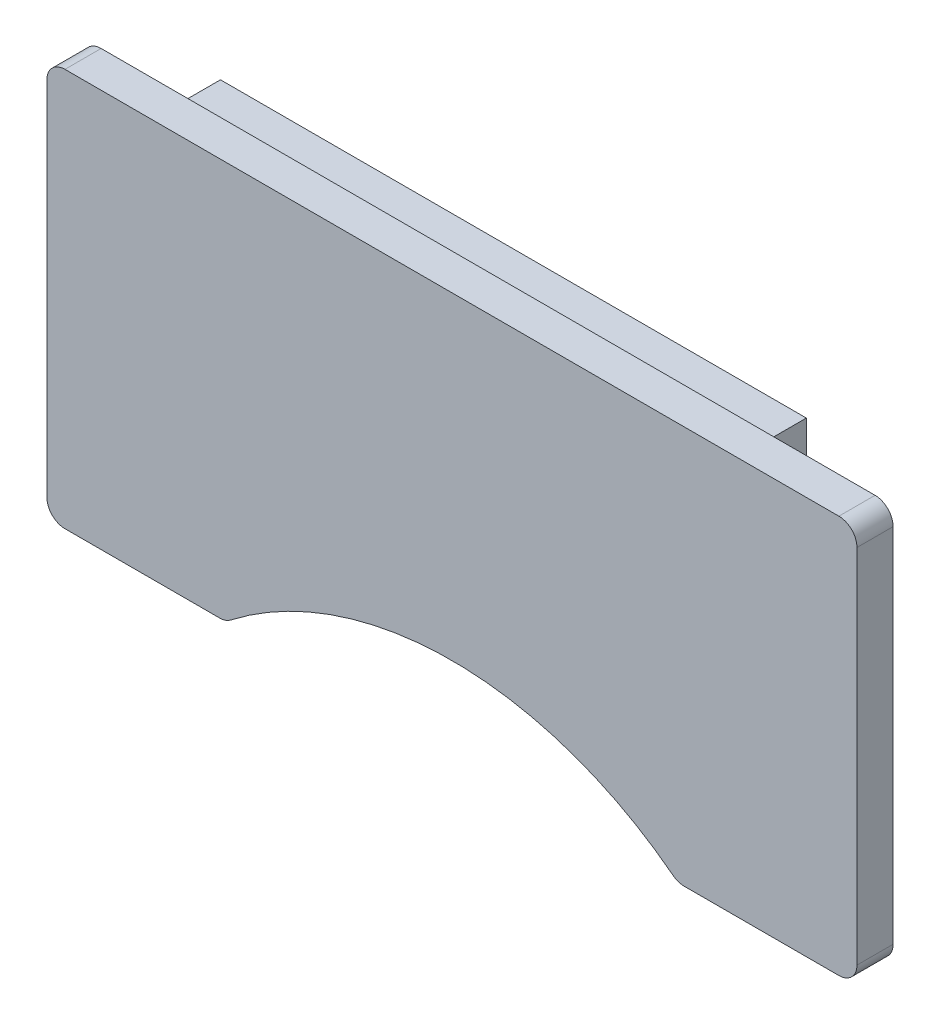
ISO-10303-21;
HEADER;
FILE_DESCRIPTION(('STEP AP214'),'2;1');
FILE_NAME('part.step','',(''),(''),'','','');
FILE_SCHEMA(('AUTOMOTIVE_DESIGN { 1 0 10303 214 1 1 1 1 }'));
ENDSEC;
DATA;
#1=APPLICATION_CONTEXT('core data for automotive mechanical design processes');
#2=APPLICATION_PROTOCOL_DEFINITION('international standard','automotive_design',2000,#1);
#3=PRODUCT_CONTEXT('',#1,'mechanical');
#4=PRODUCT('Part','Part','',(#3));
#5=PRODUCT_RELATED_PRODUCT_CATEGORY('part','',(#4));
#6=PRODUCT_DEFINITION_FORMATION('','',#4);
#7=PRODUCT_DEFINITION_CONTEXT('part definition',#1,'design');
#8=PRODUCT_DEFINITION('design','',#6,#7);
#9=PRODUCT_DEFINITION_SHAPE('','',#8);
#10=(LENGTH_UNIT() NAMED_UNIT(*) SI_UNIT(.MILLI.,.METRE.));
#11=(NAMED_UNIT(*) PLANE_ANGLE_UNIT() SI_UNIT($,.RADIAN.));
#12=(NAMED_UNIT(*) SI_UNIT($,.STERADIAN.) SOLID_ANGLE_UNIT());
#13=UNCERTAINTY_MEASURE_WITH_UNIT(LENGTH_MEASURE(1.E-05),#10,'distance_accuracy_value','');
#14=(GEOMETRIC_REPRESENTATION_CONTEXT(3) GLOBAL_UNCERTAINTY_ASSIGNED_CONTEXT((#13)) GLOBAL_UNIT_ASSIGNED_CONTEXT((#10,
#11,#12)) REPRESENTATION_CONTEXT('',''));
#15=CARTESIAN_POINT('',(0.,0.,0.));
#16=DIRECTION('',(0.,0.,1.));
#17=DIRECTION('',(1.,0.,0.));
#18=AXIS2_PLACEMENT_3D('',#15,#16,#17);
#19=CARTESIAN_POINT('',(0.,0.,0.));
#20=DIRECTION('',(0.,0.,-1.));
#21=DIRECTION('',(-1.,0.,0.));
#22=AXIS2_PLACEMENT_3D('',#19,#20,#21);
#23=PLANE('',#22);
#24=DIRECTION('',(0.,1.,0.));
#25=VECTOR('',#24,1.);
#26=CARTESIAN_POINT('',(12.7,4.064,0.));
#27=LINE('',#26,#25);
#28=CARTESIAN_POINT('',(12.7,4.064,0.));
#29=VERTEX_POINT('',#28);
#30=CARTESIAN_POINT('',(12.7,6.604,0.));
#31=VERTEX_POINT('',#30);
#32=EDGE_CURVE('E202',#29,#31,#27,.T.);
#33=ORIENTED_EDGE('',*,*,#32,.T.);
#34=DIRECTION('',(-1.,0.,0.));
#35=VECTOR('',#34,1.);
#36=CARTESIAN_POINT('',(12.7,6.604,0.));
#37=LINE('',#36,#35);
#38=CARTESIAN_POINT('',(-28.448,6.604,0.));
#39=VERTEX_POINT('',#38);
#40=EDGE_CURVE('E189',#31,#39,#37,.T.);
#41=ORIENTED_EDGE('',*,*,#40,.T.);
#42=DIRECTION('',(0.,-1.,0.));
#43=VECTOR('',#42,1.);
#44=CARTESIAN_POINT('',(-28.448,-13.97,0.));
#45=LINE('',#44,#43);
#46=CARTESIAN_POINT('',(-28.448,12.7,0.));
#47=VERTEX_POINT('',#46);
#48=EDGE_CURVE('E200',#47,#39,#45,.T.);
#49=ORIENTED_EDGE('',*,*,#48,.F.);
#50=CARTESIAN_POINT('',(-27.178,12.7,0.));
#51=DIRECTION('',(0.,0.,-1.));
#52=DIRECTION('',(-1.,0.,0.));
#53=AXIS2_PLACEMENT_3D('',#50,#51,#52);
#54=CIRCLE('',#53,1.27);
#55=CARTESIAN_POINT('',(-27.178,13.97,0.));
#56=VERTEX_POINT('',#55);
#57=EDGE_CURVE('E385',#47,#56,#54,.T.);
#58=ORIENTED_EDGE('',*,*,#57,.T.);
#59=DIRECTION('',(-1.,0.,0.));
#60=VECTOR('',#59,1.);
#61=CARTESIAN_POINT('',(-28.448,13.97,0.));
#62=LINE('',#61,#60);
#63=CARTESIAN_POINT('',(27.178,13.97,0.));
#64=VERTEX_POINT('',#63);
#65=EDGE_CURVE('E219',#64,#56,#62,.T.);
#66=ORIENTED_EDGE('',*,*,#65,.F.);
#67=CARTESIAN_POINT('',(27.178,12.7,0.));
#68=DIRECTION('',(0.,0.,-1.));
#69=DIRECTION('',(-1.,0.,0.));
#70=AXIS2_PLACEMENT_3D('',#67,#68,#69);
#71=CIRCLE('',#70,1.27);
#72=CARTESIAN_POINT('',(28.448,12.7,0.));
#73=VERTEX_POINT('',#72);
#74=EDGE_CURVE('E387',#64,#73,#71,.T.);
#75=ORIENTED_EDGE('',*,*,#74,.T.);
#76=DIRECTION('',(0.,1.,0.));
#77=VECTOR('',#76,1.);
#78=CARTESIAN_POINT('',(28.448,-13.97,0.));
#79=LINE('',#78,#77);
#80=CARTESIAN_POINT('',(28.448,-12.7,0.));
#81=VERTEX_POINT('',#80);
#82=EDGE_CURVE('E223',#81,#73,#79,.T.);
#83=ORIENTED_EDGE('',*,*,#82,.F.);
#84=CARTESIAN_POINT('',(27.178,-12.7,0.));
#85=DIRECTION('',(0.,0.,-1.));
#86=DIRECTION('',(-1.,0.,0.));
#87=AXIS2_PLACEMENT_3D('',#84,#85,#86);
#88=CIRCLE('',#87,1.27);
#89=CARTESIAN_POINT('',(27.178,-13.97,0.));
#90=VERTEX_POINT('',#89);
#91=EDGE_CURVE('E389',#81,#90,#88,.T.);
#92=ORIENTED_EDGE('',*,*,#91,.T.);
#93=DIRECTION('',(1.,0.,0.));
#94=VECTOR('',#93,1.);
#95=CARTESIAN_POINT('',(-28.448,-13.97,0.));
#96=LINE('',#95,#94);
#97=CARTESIAN_POINT('',(16.3146816898742,-13.97,0.));
#98=VERTEX_POINT('',#97);
#99=EDGE_CURVE('E211',#98,#90,#96,.T.);
#100=ORIENTED_EDGE('',*,*,#99,.F.);
#101=CARTESIAN_POINT('',(16.3146816898742,-12.7,0.));
#102=DIRECTION('',(0.,0.,-1.));
#103=DIRECTION('',(-1.,0.,0.));
#104=AXIS2_PLACEMENT_3D('',#101,#102,#103);
#105=CIRCLE('',#104,1.27);
#106=CARTESIAN_POINT('',(15.5377920855945,-13.7046604116626,0.));
#107=VERTEX_POINT('',#106);
#108=EDGE_CURVE('E395',#98,#107,#105,.T.);
#109=ORIENTED_EDGE('',*,*,#108,.T.);
#110=CARTESIAN_POINT('',(0.,-33.7978686449149,0.));
#111=DIRECTION('',(0.,0.,1.));
#112=DIRECTION('',(-1.,0.,0.));
#113=AXIS2_PLACEMENT_3D('',#110,#111,#112);
#114=CIRCLE('',#113,25.4);
#115=CARTESIAN_POINT('',(-15.5377920855945,-13.7046604116626,0.));
#116=VERTEX_POINT('',#115);
#117=EDGE_CURVE('E228',#107,#116,#114,.T.);
#118=ORIENTED_EDGE('',*,*,#117,.T.);
#119=CARTESIAN_POINT('',(-16.3146816898742,-12.7,0.));
#120=DIRECTION('',(0.,0.,-1.));
#121=DIRECTION('',(-1.,0.,0.));
#122=AXIS2_PLACEMENT_3D('',#119,#120,#121);
#123=CIRCLE('',#122,1.27);
#124=CARTESIAN_POINT('',(-16.3146816898742,-13.97,0.));
#125=VERTEX_POINT('',#124);
#126=EDGE_CURVE('E393',#116,#125,#123,.T.);
#127=ORIENTED_EDGE('',*,*,#126,.T.);
#128=CARTESIAN_POINT('',(-27.178,-13.97,0.));
#129=VERTEX_POINT('',#128);
#130=EDGE_CURVE('E216',#129,#125,#96,.T.);
#131=ORIENTED_EDGE('',*,*,#130,.F.);
#132=CARTESIAN_POINT('',(-27.178,-12.7,0.));
#133=DIRECTION('',(0.,0.,-1.));
#134=DIRECTION('',(-1.,0.,0.));
#135=AXIS2_PLACEMENT_3D('',#132,#133,#134);
#136=CIRCLE('',#135,1.27);
#137=CARTESIAN_POINT('',(-28.448,-12.7,0.));
#138=VERTEX_POINT('',#137);
#139=EDGE_CURVE('E391',#129,#138,#136,.T.);
#140=ORIENTED_EDGE('',*,*,#139,.T.);
#141=CARTESIAN_POINT('',(-28.448,-6.604,0.));
#142=VERTEX_POINT('',#141);
#143=EDGE_CURVE('E214',#142,#138,#45,.T.);
#144=ORIENTED_EDGE('',*,*,#143,.F.);
#145=DIRECTION('',(-1.,0.,0.));
#146=VECTOR('',#145,1.);
#147=CARTESIAN_POINT('',(12.7,-6.604,0.));
#148=LINE('',#147,#146);
#149=CARTESIAN_POINT('',(12.7,-6.604,0.));
#150=VERTEX_POINT('',#149);
#151=EDGE_CURVE('E256',#150,#142,#148,.T.);
#152=ORIENTED_EDGE('',*,*,#151,.F.);
#153=DIRECTION('',(0.,1.,0.));
#154=VECTOR('',#153,1.);
#155=CARTESIAN_POINT('',(12.7,-6.604,0.));
#156=LINE('',#155,#154);
#157=CARTESIAN_POINT('',(12.7,-4.064,0.));
#158=VERTEX_POINT('',#157);
#159=EDGE_CURVE('E265',#150,#158,#156,.T.);
#160=ORIENTED_EDGE('',*,*,#159,.T.);
#161=DIRECTION('',(-1.,0.,0.));
#162=VECTOR('',#161,1.);
#163=CARTESIAN_POINT('',(12.7,-4.064,0.));
#164=LINE('',#163,#162);
#165=CARTESIAN_POINT('',(-28.448,-4.064,0.));
#166=VERTEX_POINT('',#165);
#167=EDGE_CURVE('E253',#158,#166,#164,.T.);
#168=ORIENTED_EDGE('',*,*,#167,.T.);
#169=CARTESIAN_POINT('',(-28.448,4.064,0.));
#170=VERTEX_POINT('',#169);
#171=EDGE_CURVE('E212',#170,#166,#45,.T.);
#172=ORIENTED_EDGE('',*,*,#171,.F.);
#173=DIRECTION('',(-1.,0.,0.));
#174=VECTOR('',#173,1.);
#175=CARTESIAN_POINT('',(12.7,4.064,0.));
#176=LINE('',#175,#174);
#177=EDGE_CURVE('E204',#29,#170,#176,.T.);
#178=ORIENTED_EDGE('',*,*,#177,.F.);
#179=EDGE_LOOP('',(#33,#41,#49,#58,#66,#75,#83,#92,#100,#109,#118,#127,#131,#140,#144,#152,#160,
#168,#172,#178));
#180=FACE_BOUND('',#179,.T.);
#181=ADVANCED_FACE('F45',(#180),#23,.T.);
#182=CARTESIAN_POINT('',(-28.448,-13.97,2.54));
#183=DIRECTION('',(0.,1.,0.));
#184=DIRECTION('',(0.,0.,1.));
#185=AXIS2_PLACEMENT_3D('',#182,#183,#184);
#186=PLANE('',#185);
#187=ORIENTED_EDGE('',*,*,#130,.T.);
#188=DIRECTION('',(0.,0.,1.));
#189=VECTOR('',#188,1.);
#190=CARTESIAN_POINT('',(-16.3146816898742,-13.97,2.54));
#191=LINE('',#190,#189);
#192=CARTESIAN_POINT('',(-16.3146816898742,-13.97,2.54));
#193=VERTEX_POINT('',#192);
#194=EDGE_CURVE('E400',#125,#193,#191,.T.);
#195=ORIENTED_EDGE('',*,*,#194,.T.);
#196=DIRECTION('',(1.,0.,0.));
#197=VECTOR('',#196,1.);
#198=CARTESIAN_POINT('',(-28.448,-13.97,2.54));
#199=LINE('',#198,#197);
#200=CARTESIAN_POINT('',(-27.178,-13.97,2.54));
#201=VERTEX_POINT('',#200);
#202=EDGE_CURVE('E234',#201,#193,#199,.T.);
#203=ORIENTED_EDGE('',*,*,#202,.F.);
#204=DIRECTION('',(0.,0.,-1.));
#205=VECTOR('',#204,1.);
#206=CARTESIAN_POINT('',(-27.178,-13.97,2.54));
#207=LINE('',#206,#205);
#208=EDGE_CURVE('E397',#201,#129,#207,.T.);
#209=ORIENTED_EDGE('',*,*,#208,.T.);
#210=EDGE_LOOP('',(#187,#195,#203,#209));
#211=FACE_BOUND('',#210,.T.);
#212=ADVANCED_FACE('F312',(#211),#186,.F.);
#213=CARTESIAN_POINT('',(28.448,-13.97,2.54));
#214=DIRECTION('',(-1.,0.,0.));
#215=DIRECTION('',(0.,0.,1.));
#216=AXIS2_PLACEMENT_3D('',#213,#214,#215);
#217=PLANE('',#216);
#218=DIRECTION('',(0.,1.,0.));
#219=VECTOR('',#218,1.);
#220=CARTESIAN_POINT('',(28.448,-13.97,2.54));
#221=LINE('',#220,#219);
#222=CARTESIAN_POINT('',(28.448,-12.7,2.54));
#223=VERTEX_POINT('',#222);
#224=CARTESIAN_POINT('',(28.448,12.7,2.54));
#225=VERTEX_POINT('',#224);
#226=EDGE_CURVE('E241',#223,#225,#221,.T.);
#227=ORIENTED_EDGE('',*,*,#226,.F.);
#228=DIRECTION('',(0.,0.,-1.));
#229=VECTOR('',#228,1.);
#230=CARTESIAN_POINT('',(28.448,-12.7,2.54));
#231=LINE('',#230,#229);
#232=EDGE_CURVE('E407',#223,#81,#231,.T.);
#233=ORIENTED_EDGE('',*,*,#232,.T.);
#234=ORIENTED_EDGE('',*,*,#82,.T.);
#235=DIRECTION('',(0.,0.,-1.));
#236=VECTOR('',#235,1.);
#237=CARTESIAN_POINT('',(28.448,12.7,2.54));
#238=LINE('',#237,#236);
#239=EDGE_CURVE('E364',#73,#225,#238,.F.);
#240=ORIENTED_EDGE('',*,*,#239,.T.);
#241=EDGE_LOOP('',(#227,#233,#234,#240));
#242=FACE_BOUND('',#241,.T.);
#243=ADVANCED_FACE('F319',(#242),#217,.F.);
#244=CARTESIAN_POINT('',(-28.448,13.97,2.54));
#245=DIRECTION('',(0.,-1.,0.));
#246=DIRECTION('',(1.,0.,0.));
#247=AXIS2_PLACEMENT_3D('',#244,#245,#246);
#248=PLANE('',#247);
#249=DIRECTION('',(-1.,0.,0.));
#250=VECTOR('',#249,1.);
#251=CARTESIAN_POINT('',(-28.448,13.97,2.54));
#252=LINE('',#251,#250);
#253=CARTESIAN_POINT('',(27.178,13.97,2.54));
#254=VERTEX_POINT('',#253);
#255=CARTESIAN_POINT('',(-27.178,13.97,2.54));
#256=VERTEX_POINT('',#255);
#257=EDGE_CURVE('E238',#254,#256,#252,.T.);
#258=ORIENTED_EDGE('',*,*,#257,.F.);
#259=DIRECTION('',(0.,0.,-1.));
#260=VECTOR('',#259,1.);
#261=CARTESIAN_POINT('',(27.178,13.97,2.54));
#262=LINE('',#261,#260);
#263=EDGE_CURVE('E11',#254,#64,#262,.T.);
#264=ORIENTED_EDGE('',*,*,#263,.T.);
#265=ORIENTED_EDGE('',*,*,#65,.T.);
#266=DIRECTION('',(0.,0.,-1.));
#267=VECTOR('',#266,1.);
#268=CARTESIAN_POINT('',(-27.178,13.97,2.54));
#269=LINE('',#268,#267);
#270=EDGE_CURVE('E53',#56,#256,#269,.F.);
#271=ORIENTED_EDGE('',*,*,#270,.T.);
#272=EDGE_LOOP('',(#258,#264,#265,#271));
#273=FACE_BOUND('',#272,.T.);
#274=ADVANCED_FACE('F331',(#273),#248,.F.);
#275=CARTESIAN_POINT('',(-28.448,-13.97,2.54));
#276=DIRECTION('',(1.,0.,0.));
#277=DIRECTION('',(0.,0.,-1.));
#278=AXIS2_PLACEMENT_3D('',#275,#276,#277);
#279=PLANE('',#278);
#280=DIRECTION('',(0.,0.,-1.));
#281=VECTOR('',#280,1.);
#282=CARTESIAN_POINT('',(-28.448,4.064,-7.112));
#283=LINE('',#282,#281);
#284=CARTESIAN_POINT('',(-28.448,4.064,-7.112));
#285=VERTEX_POINT('',#284);
#286=EDGE_CURVE('E68',#170,#285,#283,.T.);
#287=ORIENTED_EDGE('',*,*,#286,.F.);
#288=ORIENTED_EDGE('',*,*,#171,.T.);
#289=DIRECTION('',(0.,0.,1.));
#290=VECTOR('',#289,1.);
#291=CARTESIAN_POINT('',(-28.448,-4.064,0.));
#292=LINE('',#291,#290);
#293=CARTESIAN_POINT('',(-28.448,-4.064,-7.112));
#294=VERTEX_POINT('',#293);
#295=EDGE_CURVE('E281',#294,#166,#292,.T.);
#296=ORIENTED_EDGE('',*,*,#295,.F.);
#297=DIRECTION('',(0.,-1.,0.));
#298=VECTOR('',#297,1.);
#299=CARTESIAN_POINT('',(-28.448,-4.064,-7.112));
#300=LINE('',#299,#298);
#301=EDGE_CURVE('E283',#285,#294,#300,.T.);
#302=ORIENTED_EDGE('',*,*,#301,.F.);
#303=EDGE_LOOP('',(#287,#288,#296,#302));
#304=FACE_BOUND('',#303,.T.);
#305=ORIENTED_EDGE('',*,*,#48,.T.);
#306=DIRECTION('',(0.,0.,-1.));
#307=VECTOR('',#306,1.);
#308=CARTESIAN_POINT('',(-28.448,6.604,-7.112));
#309=LINE('',#308,#307);
#310=CARTESIAN_POINT('',(-28.448,6.604,-9.652));
#311=VERTEX_POINT('',#310);
#312=EDGE_CURVE('E185',#39,#311,#309,.T.);
#313=ORIENTED_EDGE('',*,*,#312,.T.);
#314=DIRECTION('',(0.,-1.,0.));
#315=VECTOR('',#314,1.);
#316=CARTESIAN_POINT('',(-28.448,-4.064,-9.652));
#317=LINE('',#316,#315);
#318=CARTESIAN_POINT('',(-28.448,-6.604,-9.652));
#319=VERTEX_POINT('',#318);
#320=EDGE_CURVE('E196',#311,#319,#317,.T.);
#321=ORIENTED_EDGE('',*,*,#320,.T.);
#322=DIRECTION('',(0.,0.,1.));
#323=VECTOR('',#322,1.);
#324=CARTESIAN_POINT('',(-28.448,-6.604,0.));
#325=LINE('',#324,#323);
#326=EDGE_CURVE('E60',#319,#142,#325,.T.);
#327=ORIENTED_EDGE('',*,*,#326,.T.);
#328=ORIENTED_EDGE('',*,*,#143,.T.);
#329=DIRECTION('',(0.,0.,-1.));
#330=VECTOR('',#329,1.);
#331=CARTESIAN_POINT('',(-28.448,-12.7,2.54));
#332=LINE('',#331,#330);
#333=CARTESIAN_POINT('',(-28.448,-12.7,2.54));
#334=VERTEX_POINT('',#333);
#335=EDGE_CURVE('E404',#138,#334,#332,.F.);
#336=ORIENTED_EDGE('',*,*,#335,.T.);
#337=DIRECTION('',(0.,-1.,0.));
#338=VECTOR('',#337,1.);
#339=CARTESIAN_POINT('',(-28.448,-13.97,2.54));
#340=LINE('',#339,#338);
#341=CARTESIAN_POINT('',(-28.448,12.7,2.54));
#342=VERTEX_POINT('',#341);
#343=EDGE_CURVE('E235',#342,#334,#340,.T.);
#344=ORIENTED_EDGE('',*,*,#343,.F.);
#345=DIRECTION('',(0.,0.,-1.));
#346=VECTOR('',#345,1.);
#347=CARTESIAN_POINT('',(-28.448,12.7,2.54));
#348=LINE('',#347,#346);
#349=EDGE_CURVE('E210',#342,#47,#348,.T.);
#350=ORIENTED_EDGE('',*,*,#349,.T.);
#351=EDGE_LOOP('',(#305,#313,#321,#327,#328,#336,#344,#350));
#352=FACE_BOUND('',#351,.T.);
#353=ADVANCED_FACE('F207',(#304,#352),#279,.F.);
#354=CARTESIAN_POINT('',(16.3146816898742,-13.97,2.54));
#355=VERTEX_POINT('',#354);
#356=CARTESIAN_POINT('',(27.178,-13.97,2.54));
#357=VERTEX_POINT('',#356);
#358=EDGE_CURVE('E231',#355,#357,#199,.T.);
#359=ORIENTED_EDGE('',*,*,#358,.F.);
#360=DIRECTION('',(0.,0.,1.));
#361=VECTOR('',#360,1.);
#362=CARTESIAN_POINT('',(16.3146816898742,-13.97,2.54));
#363=LINE('',#362,#361);
#364=EDGE_CURVE('E383',#355,#98,#363,.F.);
#365=ORIENTED_EDGE('',*,*,#364,.T.);
#366=ORIENTED_EDGE('',*,*,#99,.T.);
#367=DIRECTION('',(0.,0.,-1.));
#368=VECTOR('',#367,1.);
#369=CARTESIAN_POINT('',(27.178,-13.97,2.54));
#370=LINE('',#369,#368);
#371=EDGE_CURVE('E381',#90,#357,#370,.F.);
#372=ORIENTED_EDGE('',*,*,#371,.T.);
#373=EDGE_LOOP('',(#359,#365,#366,#372));
#374=FACE_BOUND('',#373,.T.);
#375=ADVANCED_FACE('F322',(#374),#186,.F.);
#376=CARTESIAN_POINT('',(0.,0.,2.54));
#377=DIRECTION('',(0.,0.,-1.));
#378=DIRECTION('',(-1.,0.,0.));
#379=AXIS2_PLACEMENT_3D('',#376,#377,#378);
#380=PLANE('',#379);
#381=CARTESIAN_POINT('',(0.,-33.7978686449149,2.54));
#382=DIRECTION('',(0.,0.,1.));
#383=DIRECTION('',(-1.,0.,0.));
#384=AXIS2_PLACEMENT_3D('',#381,#382,#383);
#385=CIRCLE('',#384,25.4);
#386=CARTESIAN_POINT('',(15.5377920855945,-13.7046604116626,2.54));
#387=VERTEX_POINT('',#386);
#388=CARTESIAN_POINT('',(-15.5377920855945,-13.7046604116626,2.54));
#389=VERTEX_POINT('',#388);
#390=EDGE_CURVE('E203',#387,#389,#385,.T.);
#391=ORIENTED_EDGE('',*,*,#390,.F.);
#392=CARTESIAN_POINT('',(16.3146816898742,-12.7,2.54));
#393=DIRECTION('',(0.,0.,-1.));
#394=DIRECTION('',(-1.,0.,0.));
#395=AXIS2_PLACEMENT_3D('',#392,#393,#394);
#396=CIRCLE('',#395,1.27);
#397=EDGE_CURVE('E379',#387,#355,#396,.F.);
#398=ORIENTED_EDGE('',*,*,#397,.T.);
#399=ORIENTED_EDGE('',*,*,#358,.T.);
#400=CARTESIAN_POINT('',(27.178,-12.7,2.54));
#401=DIRECTION('',(0.,0.,-1.));
#402=DIRECTION('',(-1.,0.,0.));
#403=AXIS2_PLACEMENT_3D('',#400,#401,#402);
#404=CIRCLE('',#403,1.27);
#405=EDGE_CURVE('E367',#357,#223,#404,.F.);
#406=ORIENTED_EDGE('',*,*,#405,.T.);
#407=ORIENTED_EDGE('',*,*,#226,.T.);
#408=CARTESIAN_POINT('',(27.178,12.7,2.54));
#409=DIRECTION('',(0.,0.,-1.));
#410=DIRECTION('',(-1.,0.,0.));
#411=AXIS2_PLACEMENT_3D('',#408,#409,#410);
#412=CIRCLE('',#411,1.27);
#413=EDGE_CURVE('E363',#225,#254,#412,.F.);
#414=ORIENTED_EDGE('',*,*,#413,.T.);
#415=ORIENTED_EDGE('',*,*,#257,.T.);
#416=CARTESIAN_POINT('',(-27.178,12.7,2.54));
#417=DIRECTION('',(0.,0.,-1.));
#418=DIRECTION('',(-1.,0.,0.));
#419=AXIS2_PLACEMENT_3D('',#416,#417,#418);
#420=CIRCLE('',#419,1.27);
#421=EDGE_CURVE('E368',#256,#342,#420,.F.);
#422=ORIENTED_EDGE('',*,*,#421,.T.);
#423=ORIENTED_EDGE('',*,*,#343,.T.);
#424=CARTESIAN_POINT('',(-27.178,-12.7,2.54));
#425=DIRECTION('',(0.,0.,-1.));
#426=DIRECTION('',(-1.,0.,0.));
#427=AXIS2_PLACEMENT_3D('',#424,#425,#426);
#428=CIRCLE('',#427,1.27);
#429=EDGE_CURVE('E370',#334,#201,#428,.F.);
#430=ORIENTED_EDGE('',*,*,#429,.T.);
#431=ORIENTED_EDGE('',*,*,#202,.T.);
#432=CARTESIAN_POINT('',(-16.3146816898742,-12.7,2.54));
#433=DIRECTION('',(0.,0.,-1.));
#434=DIRECTION('',(-1.,0.,0.));
#435=AXIS2_PLACEMENT_3D('',#432,#433,#434);
#436=CIRCLE('',#435,1.27);
#437=EDGE_CURVE('E377',#193,#389,#436,.F.);
#438=ORIENTED_EDGE('',*,*,#437,.T.);
#439=EDGE_LOOP('',(#391,#398,#399,#406,#407,#414,#415,#422,#423,#430,#431,#438));
#440=FACE_BOUND('',#439,.T.);
#441=ADVANCED_FACE('F324',(#440),#380,.F.);
#442=CARTESIAN_POINT('',(0.,-33.7978686449149,0.));
#443=DIRECTION('',(0.,0.,1.));
#444=DIRECTION('',(1.,0.,0.));
#445=AXIS2_PLACEMENT_3D('',#442,#443,#444);
#446=CYLINDRICAL_SURFACE('',#445,25.4);
#447=ORIENTED_EDGE('',*,*,#117,.F.);
#448=DIRECTION('',(0.,0.,1.));
#449=VECTOR('',#448,1.);
#450=CARTESIAN_POINT('',(15.5377920855945,-13.7046604116626,0.));
#451=LINE('',#450,#449);
#452=EDGE_CURVE('E372',#107,#387,#451,.T.);
#453=ORIENTED_EDGE('',*,*,#452,.T.);
#454=ORIENTED_EDGE('',*,*,#390,.T.);
#455=DIRECTION('',(0.,0.,1.));
#456=VECTOR('',#455,1.);
#457=CARTESIAN_POINT('',(-15.5377920855945,-13.7046604116626,0.));
#458=LINE('',#457,#456);
#459=EDGE_CURVE('E426',#389,#116,#458,.F.);
#460=ORIENTED_EDGE('',*,*,#459,.T.);
#461=EDGE_LOOP('',(#447,#453,#454,#460));
#462=FACE_BOUND('',#461,.T.);
#463=ADVANCED_FACE('F341',(#462),#446,.F.);
#464=CARTESIAN_POINT('',(16.3146816898742,-12.7,0.));
#465=DIRECTION('',(0.,0.,1.));
#466=DIRECTION('',(1.,0.,0.));
#467=AXIS2_PLACEMENT_3D('',#464,#465,#466);
#468=CYLINDRICAL_SURFACE('',#467,1.27);
#469=ORIENTED_EDGE('',*,*,#108,.F.);
#470=ORIENTED_EDGE('',*,*,#364,.F.);
#471=ORIENTED_EDGE('',*,*,#397,.F.);
#472=ORIENTED_EDGE('',*,*,#452,.F.);
#473=EDGE_LOOP('',(#469,#470,#471,#472));
#474=FACE_BOUND('',#473,.T.);
#475=ADVANCED_FACE('F337',(#474),#468,.T.);
#476=CARTESIAN_POINT('',(-16.3146816898742,-12.7,0.));
#477=DIRECTION('',(0.,0.,1.));
#478=DIRECTION('',(1.,0.,0.));
#479=AXIS2_PLACEMENT_3D('',#476,#477,#478);
#480=CYLINDRICAL_SURFACE('',#479,1.27);
#481=ORIENTED_EDGE('',*,*,#126,.F.);
#482=ORIENTED_EDGE('',*,*,#459,.F.);
#483=ORIENTED_EDGE('',*,*,#437,.F.);
#484=ORIENTED_EDGE('',*,*,#194,.F.);
#485=EDGE_LOOP('',(#481,#482,#483,#484));
#486=FACE_BOUND('',#485,.T.);
#487=ADVANCED_FACE('F340',(#486),#480,.T.);
#488=CARTESIAN_POINT('',(-27.178,-12.7,2.54));
#489=DIRECTION('',(0.,0.,-1.));
#490=DIRECTION('',(-1.,0.,0.));
#491=AXIS2_PLACEMENT_3D('',#488,#489,#490);
#492=CYLINDRICAL_SURFACE('',#491,1.27);
#493=ORIENTED_EDGE('',*,*,#429,.F.);
#494=ORIENTED_EDGE('',*,*,#335,.F.);
#495=ORIENTED_EDGE('',*,*,#139,.F.);
#496=ORIENTED_EDGE('',*,*,#208,.F.);
#497=EDGE_LOOP('',(#493,#494,#495,#496));
#498=FACE_BOUND('',#497,.T.);
#499=ADVANCED_FACE('F345',(#498),#492,.T.);
#500=CARTESIAN_POINT('',(27.178,-12.7,2.54));
#501=DIRECTION('',(0.,0.,-1.));
#502=DIRECTION('',(-1.,0.,0.));
#503=AXIS2_PLACEMENT_3D('',#500,#501,#502);
#504=CYLINDRICAL_SURFACE('',#503,1.27);
#505=ORIENTED_EDGE('',*,*,#405,.F.);
#506=ORIENTED_EDGE('',*,*,#371,.F.);
#507=ORIENTED_EDGE('',*,*,#91,.F.);
#508=ORIENTED_EDGE('',*,*,#232,.F.);
#509=EDGE_LOOP('',(#505,#506,#507,#508));
#510=FACE_BOUND('',#509,.T.);
#511=ADVANCED_FACE('F349',(#510),#504,.T.);
#512=CARTESIAN_POINT('',(27.178,12.7,2.54));
#513=DIRECTION('',(0.,0.,-1.));
#514=DIRECTION('',(-1.,0.,0.));
#515=AXIS2_PLACEMENT_3D('',#512,#513,#514);
#516=CYLINDRICAL_SURFACE('',#515,1.27);
#517=ORIENTED_EDGE('',*,*,#413,.F.);
#518=ORIENTED_EDGE('',*,*,#239,.F.);
#519=ORIENTED_EDGE('',*,*,#74,.F.);
#520=ORIENTED_EDGE('',*,*,#263,.F.);
#521=EDGE_LOOP('',(#517,#518,#519,#520));
#522=FACE_BOUND('',#521,.T.);
#523=ADVANCED_FACE('F352',(#522),#516,.T.);
#524=CARTESIAN_POINT('',(-27.178,12.7,2.54));
#525=DIRECTION('',(0.,0.,-1.));
#526=DIRECTION('',(-1.,0.,0.));
#527=AXIS2_PLACEMENT_3D('',#524,#525,#526);
#528=CYLINDRICAL_SURFACE('',#527,1.27);
#529=ORIENTED_EDGE('',*,*,#421,.F.);
#530=ORIENTED_EDGE('',*,*,#270,.F.);
#531=ORIENTED_EDGE('',*,*,#57,.F.);
#532=ORIENTED_EDGE('',*,*,#349,.F.);
#533=EDGE_LOOP('',(#529,#530,#531,#532));
#534=FACE_BOUND('',#533,.T.);
#535=ADVANCED_FACE('F47',(#534),#528,.T.);
#536=CARTESIAN_POINT('',(12.7,6.604,-7.112));
#537=DIRECTION('',(0.,-1.,0.));
#538=DIRECTION('',(0.,0.,-1.));
#539=AXIS2_PLACEMENT_3D('',#536,#537,#538);
#540=PLANE('',#539);
#541=DIRECTION('',(-1.,0.,0.));
#542=VECTOR('',#541,1.);
#543=CARTESIAN_POINT('',(12.7,6.604,-9.652));
#544=LINE('',#543,#542);
#545=CARTESIAN_POINT('',(12.7,6.604,-9.652));
#546=VERTEX_POINT('',#545);
#547=EDGE_CURVE('E192',#546,#311,#544,.T.);
#548=ORIENTED_EDGE('',*,*,#547,.T.);
#549=ORIENTED_EDGE('',*,*,#312,.F.);
#550=ORIENTED_EDGE('',*,*,#40,.F.);
#551=DIRECTION('',(0.,0.,-1.));
#552=VECTOR('',#551,1.);
#553=CARTESIAN_POINT('',(12.7,6.604,-7.112));
#554=LINE('',#553,#552);
#555=EDGE_CURVE('E195',#546,#31,#554,.F.);
#556=ORIENTED_EDGE('',*,*,#555,.F.);
#557=EDGE_LOOP('',(#548,#549,#550,#556));
#558=FACE_BOUND('',#557,.T.);
#559=ADVANCED_FACE('F187',(#558),#540,.F.);
#560=CARTESIAN_POINT('',(12.7,4.064,-7.112));
#561=DIRECTION('',(0.,-1.,0.));
#562=DIRECTION('',(0.,0.,-1.));
#563=AXIS2_PLACEMENT_3D('',#560,#561,#562);
#564=PLANE('',#563);
#565=ORIENTED_EDGE('',*,*,#177,.T.);
#566=ORIENTED_EDGE('',*,*,#286,.T.);
#567=DIRECTION('',(-1.,0.,0.));
#568=VECTOR('',#567,1.);
#569=CARTESIAN_POINT('',(12.7,4.064,-7.112));
#570=LINE('',#569,#568);
#571=CARTESIAN_POINT('',(12.7,4.064,-7.112));
#572=VERTEX_POINT('',#571);
#573=EDGE_CURVE('E249',#572,#285,#570,.T.);
#574=ORIENTED_EDGE('',*,*,#573,.F.);
#575=DIRECTION('',(0.,0.,1.));
#576=VECTOR('',#575,1.);
#577=CARTESIAN_POINT('',(12.7,4.064,-7.112));
#578=LINE('',#577,#576);
#579=EDGE_CURVE('E274',#572,#29,#578,.T.);
#580=ORIENTED_EDGE('',*,*,#579,.T.);
#581=EDGE_LOOP('',(#565,#566,#574,#580));
#582=FACE_BOUND('',#581,.T.);
#583=ADVANCED_FACE('F287',(#582),#564,.T.);
#584=CARTESIAN_POINT('',(12.7,-4.064,-7.112));
#585=DIRECTION('',(0.,0.,1.));
#586=DIRECTION('',(1.,0.,0.));
#587=AXIS2_PLACEMENT_3D('',#584,#585,#586);
#588=PLANE('',#587);
#589=ORIENTED_EDGE('',*,*,#573,.T.);
#590=ORIENTED_EDGE('',*,*,#301,.T.);
#591=DIRECTION('',(-1.,0.,0.));
#592=VECTOR('',#591,1.);
#593=CARTESIAN_POINT('',(12.7,-4.064,-7.112));
#594=LINE('',#593,#592);
#595=CARTESIAN_POINT('',(12.7,-4.064,-7.112));
#596=VERTEX_POINT('',#595);
#597=EDGE_CURVE('E251',#596,#294,#594,.T.);
#598=ORIENTED_EDGE('',*,*,#597,.F.);
#599=DIRECTION('',(0.,1.,0.));
#600=VECTOR('',#599,1.);
#601=CARTESIAN_POINT('',(12.7,-4.064,-7.112));
#602=LINE('',#601,#600);
#603=EDGE_CURVE('E271',#596,#572,#602,.T.);
#604=ORIENTED_EDGE('',*,*,#603,.T.);
#605=EDGE_LOOP('',(#589,#590,#598,#604));
#606=FACE_BOUND('',#605,.T.);
#607=ADVANCED_FACE('F293',(#606),#588,.T.);
#608=CARTESIAN_POINT('',(12.7,-4.064,0.));
#609=DIRECTION('',(0.,1.,0.));
#610=DIRECTION('',(0.,0.,1.));
#611=AXIS2_PLACEMENT_3D('',#608,#609,#610);
#612=PLANE('',#611);
#613=ORIENTED_EDGE('',*,*,#597,.T.);
#614=ORIENTED_EDGE('',*,*,#295,.T.);
#615=ORIENTED_EDGE('',*,*,#167,.F.);
#616=DIRECTION('',(0.,0.,-1.));
#617=VECTOR('',#616,1.);
#618=CARTESIAN_POINT('',(12.7,-4.064,0.));
#619=LINE('',#618,#617);
#620=EDGE_CURVE('E268',#158,#596,#619,.T.);
#621=ORIENTED_EDGE('',*,*,#620,.T.);
#622=EDGE_LOOP('',(#613,#614,#615,#621));
#623=FACE_BOUND('',#622,.T.);
#624=ADVANCED_FACE('F299',(#623),#612,.T.);
#625=CARTESIAN_POINT('',(12.7,-6.604,0.));
#626=DIRECTION('',(0.,1.,0.));
#627=DIRECTION('',(0.,0.,1.));
#628=AXIS2_PLACEMENT_3D('',#625,#626,#627);
#629=PLANE('',#628);
#630=ORIENTED_EDGE('',*,*,#151,.T.);
#631=ORIENTED_EDGE('',*,*,#326,.F.);
#632=DIRECTION('',(-1.,0.,0.));
#633=VECTOR('',#632,1.);
#634=CARTESIAN_POINT('',(12.7,-6.604,-9.652));
#635=LINE('',#634,#633);
#636=CARTESIAN_POINT('',(12.7,-6.604,-9.652));
#637=VERTEX_POINT('',#636);
#638=EDGE_CURVE('E258',#637,#319,#635,.T.);
#639=ORIENTED_EDGE('',*,*,#638,.F.);
#640=DIRECTION('',(0.,0.,-1.));
#641=VECTOR('',#640,1.);
#642=CARTESIAN_POINT('',(12.7,-6.604,0.));
#643=LINE('',#642,#641);
#644=EDGE_CURVE('E263',#150,#637,#643,.T.);
#645=ORIENTED_EDGE('',*,*,#644,.F.);
#646=EDGE_LOOP('',(#630,#631,#639,#645));
#647=FACE_BOUND('',#646,.T.);
#648=ADVANCED_FACE('F301',(#647),#629,.F.);
#649=CARTESIAN_POINT('',(12.7,-4.064,-9.652));
#650=DIRECTION('',(0.,0.,1.));
#651=DIRECTION('',(1.,0.,0.));
#652=AXIS2_PLACEMENT_3D('',#649,#650,#651);
#653=PLANE('',#652);
#654=ORIENTED_EDGE('',*,*,#638,.T.);
#655=ORIENTED_EDGE('',*,*,#320,.F.);
#656=ORIENTED_EDGE('',*,*,#547,.F.);
#657=DIRECTION('',(0.,1.,0.));
#658=VECTOR('',#657,1.);
#659=CARTESIAN_POINT('',(12.7,-4.064,-9.652));
#660=LINE('',#659,#658);
#661=EDGE_CURVE('E261',#637,#546,#660,.T.);
#662=ORIENTED_EDGE('',*,*,#661,.F.);
#663=EDGE_LOOP('',(#654,#655,#656,#662));
#664=FACE_BOUND('',#663,.T.);
#665=ADVANCED_FACE('F307',(#664),#653,.F.);
#666=CARTESIAN_POINT('',(12.7,0.,0.));
#667=DIRECTION('',(1.,0.,0.));
#668=DIRECTION('',(0.,0.,-1.));
#669=AXIS2_PLACEMENT_3D('',#666,#667,#668);
#670=PLANE('',#669);
#671=ORIENTED_EDGE('',*,*,#555,.T.);
#672=ORIENTED_EDGE('',*,*,#32,.F.);
#673=ORIENTED_EDGE('',*,*,#579,.F.);
#674=ORIENTED_EDGE('',*,*,#603,.F.);
#675=ORIENTED_EDGE('',*,*,#620,.F.);
#676=ORIENTED_EDGE('',*,*,#159,.F.);
#677=ORIENTED_EDGE('',*,*,#644,.T.);
#678=ORIENTED_EDGE('',*,*,#661,.T.);
#679=EDGE_LOOP('',(#671,#672,#673,#674,#675,#676,#677,#678));
#680=FACE_BOUND('',#679,.T.);
#681=ADVANCED_FACE('F297',(#680),#670,.T.);
#682=CLOSED_SHELL('',(#181,#212,#243,#274,#353,#375,#441,#463,#475,#487,#499,#511,#523,#535,
#559,#583,#607,#624,#648,#665,#681));
#683=MANIFOLD_SOLID_BREP('B2',#682);
#684=ADVANCED_BREP_SHAPE_REPRESENTATION('',(#18,#683),#14);
#685=SHAPE_DEFINITION_REPRESENTATION(#9,#684);
ENDSEC;
END-ISO-10303-21;
